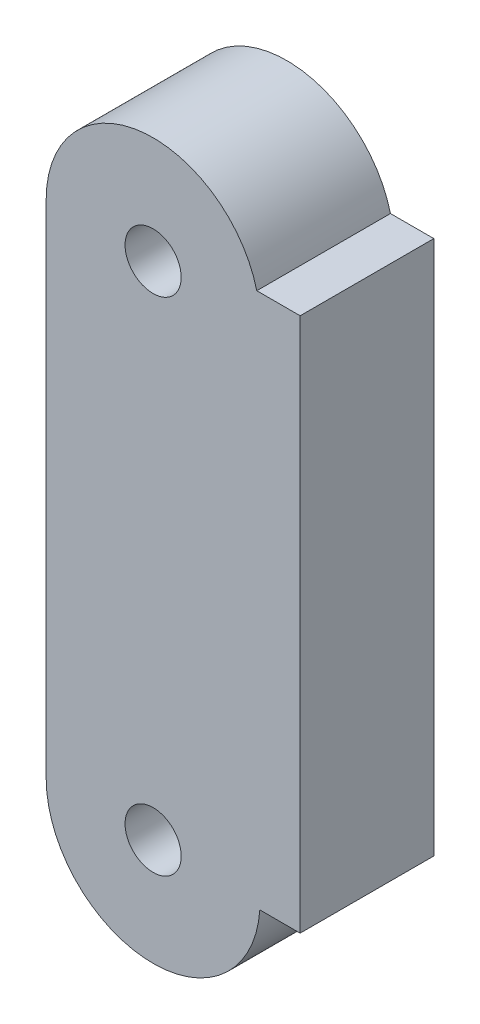
ISO-10303-21;
HEADER;
FILE_DESCRIPTION(('STEP AP214'),'2;1');
FILE_NAME('part.step','',(''),(''),'','','');
FILE_SCHEMA(('AUTOMOTIVE_DESIGN { 1 0 10303 214 1 1 1 1 }'));
ENDSEC;
DATA;
#1=APPLICATION_CONTEXT('core data for automotive mechanical design processes');
#2=APPLICATION_PROTOCOL_DEFINITION('international standard','automotive_design',2000,#1);
#3=PRODUCT_CONTEXT('',#1,'mechanical');
#4=PRODUCT('Part','Part','',(#3));
#5=PRODUCT_RELATED_PRODUCT_CATEGORY('part','',(#4));
#6=PRODUCT_DEFINITION_FORMATION('','',#4);
#7=PRODUCT_DEFINITION_CONTEXT('part definition',#1,'design');
#8=PRODUCT_DEFINITION('design','',#6,#7);
#9=PRODUCT_DEFINITION_SHAPE('','',#8);
#10=(LENGTH_UNIT() NAMED_UNIT(*) SI_UNIT(.MILLI.,.METRE.));
#11=(NAMED_UNIT(*) PLANE_ANGLE_UNIT() SI_UNIT($,.RADIAN.));
#12=(NAMED_UNIT(*) SI_UNIT($,.STERADIAN.) SOLID_ANGLE_UNIT());
#13=UNCERTAINTY_MEASURE_WITH_UNIT(LENGTH_MEASURE(1.E-05),#10,'distance_accuracy_value','');
#14=(GEOMETRIC_REPRESENTATION_CONTEXT(3) GLOBAL_UNCERTAINTY_ASSIGNED_CONTEXT((#13)) GLOBAL_UNIT_ASSIGNED_CONTEXT((#10,
#11,#12)) REPRESENTATION_CONTEXT('',''));
#15=CARTESIAN_POINT('',(0.,0.,0.));
#16=DIRECTION('',(0.,0.,1.));
#17=DIRECTION('',(1.,0.,0.));
#18=AXIS2_PLACEMENT_3D('',#15,#16,#17);
#19=CARTESIAN_POINT('',(-11.,-4.462,10.));
#20=DIRECTION('',(0.,0.,1.));
#21=DIRECTION('',(1.,0.,0.));
#22=AXIS2_PLACEMENT_3D('',#19,#20,#21);
#23=PLANE('',#22);
#24=CARTESIAN_POINT('',(-11.,-4.462,10.));
#25=DIRECTION('',(0.,0.,1.));
#26=DIRECTION('',(1.,0.,0.));
#27=AXIS2_PLACEMENT_3D('',#24,#25,#26);
#28=CIRCLE('',#27,2.1);
#29=CARTESIAN_POINT('',(-8.9,-4.462,10.));
#30=VERTEX_POINT('',#29);
#31=EDGE_CURVE('E126',#30,#30,#28,.T.);
#32=ORIENTED_EDGE('',*,*,#31,.F.);
#33=EDGE_LOOP('',(#32));
#34=FACE_BOUND('',#33,.T.);
#35=DIRECTION('',(0.,1.,0.));
#36=VECTOR('',#35,1.);
#37=CARTESIAN_POINT('',(0.,35.,10.));
#38=LINE('',#37,#36);
#39=CARTESIAN_POINT('',(0.,-5.,10.));
#40=VERTEX_POINT('',#39);
#41=CARTESIAN_POINT('',(0.,35.,10.));
#42=VERTEX_POINT('',#41);
#43=EDGE_CURVE('E133',#40,#42,#38,.T.);
#44=ORIENTED_EDGE('',*,*,#43,.T.);
#45=DIRECTION('',(-1.,0.,0.));
#46=VECTOR('',#45,1.);
#47=CARTESIAN_POINT('',(-3.24432104841878,35.,10.));
#48=LINE('',#47,#46);
#49=CARTESIAN_POINT('',(-3.24432104841878,35.,10.));
#50=VERTEX_POINT('',#49);
#51=EDGE_CURVE('E91',#42,#50,#48,.T.);
#52=ORIENTED_EDGE('',*,*,#51,.T.);
#53=CARTESIAN_POINT('',(-11.,33.038,10.));
#54=DIRECTION('',(0.,0.,1.));
#55=DIRECTION('',(1.,0.,0.));
#56=AXIS2_PLACEMENT_3D('',#53,#54,#55);
#57=CIRCLE('',#56,8.);
#58=CARTESIAN_POINT('',(-19.,33.038,10.));
#59=VERTEX_POINT('',#58);
#60=EDGE_CURVE('E104',#50,#59,#57,.T.);
#61=ORIENTED_EDGE('',*,*,#60,.T.);
#62=DIRECTION('',(0.,-1.,0.));
#63=VECTOR('',#62,1.);
#64=CARTESIAN_POINT('',(-19.,33.038,10.));
#65=LINE('',#64,#63);
#66=CARTESIAN_POINT('',(-19.,-4.462,10.));
#67=VERTEX_POINT('',#66);
#68=EDGE_CURVE('E98',#59,#67,#65,.T.);
#69=ORIENTED_EDGE('',*,*,#68,.T.);
#70=CARTESIAN_POINT('',(-11.,-4.462,10.));
#71=DIRECTION('',(0.,0.,1.));
#72=DIRECTION('',(1.,0.,0.));
#73=AXIS2_PLACEMENT_3D('',#70,#71,#72);
#74=CIRCLE('',#73,8.);
#75=CARTESIAN_POINT('',(-3.01811074995399,-5.,10.));
#76=VERTEX_POINT('',#75);
#77=EDGE_CURVE('E102',#67,#76,#74,.T.);
#78=ORIENTED_EDGE('',*,*,#77,.T.);
#79=DIRECTION('',(1.,0.,0.));
#80=VECTOR('',#79,1.);
#81=CARTESIAN_POINT('',(-3.01811074995399,-5.,10.));
#82=LINE('',#81,#80);
#83=EDGE_CURVE('E54',#76,#40,#82,.T.);
#84=ORIENTED_EDGE('',*,*,#83,.T.);
#85=EDGE_LOOP('',(#44,#52,#61,#69,#78,#84));
#86=FACE_BOUND('',#85,.T.);
#87=CARTESIAN_POINT('',(-11.,33.038,10.));
#88=DIRECTION('',(0.,0.,1.));
#89=DIRECTION('',(1.,0.,0.));
#90=AXIS2_PLACEMENT_3D('',#87,#88,#89);
#91=CIRCLE('',#90,2.1);
#92=CARTESIAN_POINT('',(-8.9,33.038,10.));
#93=VERTEX_POINT('',#92);
#94=EDGE_CURVE('E175',#93,#93,#91,.T.);
#95=ORIENTED_EDGE('',*,*,#94,.F.);
#96=EDGE_LOOP('',(#95));
#97=FACE_BOUND('',#96,.T.);
#98=ADVANCED_FACE('F37',(#34,#86,#97),#23,.T.);
#99=CARTESIAN_POINT('',(-11.,-4.462,0.));
#100=DIRECTION('',(0.,0.,1.));
#101=DIRECTION('',(1.,0.,0.));
#102=AXIS2_PLACEMENT_3D('',#99,#100,#101);
#103=PLANE('',#102);
#104=DIRECTION('',(0.,1.,0.));
#105=VECTOR('',#104,1.);
#106=CARTESIAN_POINT('',(0.,35.,0.));
#107=LINE('',#106,#105);
#108=CARTESIAN_POINT('',(0.,-5.,0.));
#109=VERTEX_POINT('',#108);
#110=CARTESIAN_POINT('',(0.,35.,0.));
#111=VERTEX_POINT('',#110);
#112=EDGE_CURVE('E122',#109,#111,#107,.T.);
#113=ORIENTED_EDGE('',*,*,#112,.F.);
#114=DIRECTION('',(1.,0.,0.));
#115=VECTOR('',#114,1.);
#116=CARTESIAN_POINT('',(-3.01811074995399,-5.,0.));
#117=LINE('',#116,#115);
#118=CARTESIAN_POINT('',(-3.01811074995399,-5.,0.));
#119=VERTEX_POINT('',#118);
#120=EDGE_CURVE('E83',#119,#109,#117,.T.);
#121=ORIENTED_EDGE('',*,*,#120,.F.);
#122=CARTESIAN_POINT('',(-11.,-4.462,0.));
#123=DIRECTION('',(0.,0.,1.));
#124=DIRECTION('',(1.,0.,0.));
#125=AXIS2_PLACEMENT_3D('',#122,#123,#124);
#126=CIRCLE('',#125,8.);
#127=CARTESIAN_POINT('',(-19.,-4.462,0.));
#128=VERTEX_POINT('',#127);
#129=EDGE_CURVE('E77',#128,#119,#126,.T.);
#130=ORIENTED_EDGE('',*,*,#129,.F.);
#131=DIRECTION('',(0.,-1.,0.));
#132=VECTOR('',#131,1.);
#133=CARTESIAN_POINT('',(-19.,33.038,0.));
#134=LINE('',#133,#132);
#135=CARTESIAN_POINT('',(-19.,33.038,0.));
#136=VERTEX_POINT('',#135);
#137=EDGE_CURVE('E112',#136,#128,#134,.T.);
#138=ORIENTED_EDGE('',*,*,#137,.F.);
#139=CARTESIAN_POINT('',(-11.,33.038,0.));
#140=DIRECTION('',(0.,0.,1.));
#141=DIRECTION('',(1.,0.,0.));
#142=AXIS2_PLACEMENT_3D('',#139,#140,#141);
#143=CIRCLE('',#142,8.);
#144=CARTESIAN_POINT('',(-3.24432104841878,35.,0.));
#145=VERTEX_POINT('',#144);
#146=EDGE_CURVE('E128',#145,#136,#143,.T.);
#147=ORIENTED_EDGE('',*,*,#146,.F.);
#148=DIRECTION('',(-1.,0.,0.));
#149=VECTOR('',#148,1.);
#150=CARTESIAN_POINT('',(-3.24432104841878,35.,0.));
#151=LINE('',#150,#149);
#152=EDGE_CURVE('E125',#111,#145,#151,.T.);
#153=ORIENTED_EDGE('',*,*,#152,.F.);
#154=EDGE_LOOP('',(#113,#121,#130,#138,#147,#153));
#155=FACE_BOUND('',#154,.T.);
#156=CARTESIAN_POINT('',(-11.,-4.462,0.));
#157=DIRECTION('',(0.,0.,1.));
#158=DIRECTION('',(1.,0.,0.));
#159=AXIS2_PLACEMENT_3D('',#156,#157,#158);
#160=CIRCLE('',#159,2.1);
#161=CARTESIAN_POINT('',(-8.9,-4.462,0.));
#162=VERTEX_POINT('',#161);
#163=EDGE_CURVE('E181',#162,#162,#160,.T.);
#164=ORIENTED_EDGE('',*,*,#163,.T.);
#165=EDGE_LOOP('',(#164));
#166=FACE_BOUND('',#165,.T.);
#167=CARTESIAN_POINT('',(-11.,33.038,0.));
#168=DIRECTION('',(0.,0.,1.));
#169=DIRECTION('',(1.,0.,0.));
#170=AXIS2_PLACEMENT_3D('',#167,#168,#169);
#171=CIRCLE('',#170,2.1);
#172=CARTESIAN_POINT('',(-8.9,33.038,0.));
#173=VERTEX_POINT('',#172);
#174=EDGE_CURVE('E178',#173,#173,#171,.T.);
#175=ORIENTED_EDGE('',*,*,#174,.T.);
#176=EDGE_LOOP('',(#175));
#177=FACE_BOUND('',#176,.T.);
#178=ADVANCED_FACE('F142',(#155,#166,#177),#103,.F.);
#179=CARTESIAN_POINT('',(0.,35.,10.));
#180=DIRECTION('',(-1.,0.,0.));
#181=DIRECTION('',(0.,0.,1.));
#182=AXIS2_PLACEMENT_3D('',#179,#180,#181);
#183=PLANE('',#182);
#184=ORIENTED_EDGE('',*,*,#112,.T.);
#185=DIRECTION('',(0.,0.,-1.));
#186=VECTOR('',#185,1.);
#187=CARTESIAN_POINT('',(0.,35.,10.));
#188=LINE('',#187,#186);
#189=EDGE_CURVE('E11',#42,#111,#188,.T.);
#190=ORIENTED_EDGE('',*,*,#189,.F.);
#191=ORIENTED_EDGE('',*,*,#43,.F.);
#192=DIRECTION('',(0.,0.,-1.));
#193=VECTOR('',#192,1.);
#194=CARTESIAN_POINT('',(0.,-5.,10.));
#195=LINE('',#194,#193);
#196=EDGE_CURVE('E118',#40,#109,#195,.T.);
#197=ORIENTED_EDGE('',*,*,#196,.T.);
#198=EDGE_LOOP('',(#184,#190,#191,#197));
#199=FACE_BOUND('',#198,.T.);
#200=ADVANCED_FACE('F39',(#199),#183,.F.);
#201=CARTESIAN_POINT('',(-3.24432104841878,35.,10.));
#202=DIRECTION('',(0.,-1.,0.));
#203=DIRECTION('',(0.,0.,-1.));
#204=AXIS2_PLACEMENT_3D('',#201,#202,#203);
#205=PLANE('',#204);
#206=ORIENTED_EDGE('',*,*,#152,.T.);
#207=DIRECTION('',(0.,0.,-1.));
#208=VECTOR('',#207,1.);
#209=CARTESIAN_POINT('',(-3.24432104841878,35.,10.));
#210=LINE('',#209,#208);
#211=EDGE_CURVE('E46',#50,#145,#210,.T.);
#212=ORIENTED_EDGE('',*,*,#211,.F.);
#213=ORIENTED_EDGE('',*,*,#51,.F.);
#214=ORIENTED_EDGE('',*,*,#189,.T.);
#215=EDGE_LOOP('',(#206,#212,#213,#214));
#216=FACE_BOUND('',#215,.T.);
#217=ADVANCED_FACE('F226',(#216),#205,.F.);
#218=CARTESIAN_POINT('',(-11.,33.038,10.));
#219=DIRECTION('',(0.,0.,-1.));
#220=DIRECTION('',(-1.,0.,0.));
#221=AXIS2_PLACEMENT_3D('',#218,#219,#220);
#222=CYLINDRICAL_SURFACE('',#221,8.);
#223=ORIENTED_EDGE('',*,*,#146,.T.);
#224=DIRECTION('',(0.,0.,-1.));
#225=VECTOR('',#224,1.);
#226=CARTESIAN_POINT('',(-19.,33.038,10.));
#227=LINE('',#226,#225);
#228=EDGE_CURVE('E113',#59,#136,#227,.T.);
#229=ORIENTED_EDGE('',*,*,#228,.F.);
#230=ORIENTED_EDGE('',*,*,#60,.F.);
#231=ORIENTED_EDGE('',*,*,#211,.T.);
#232=EDGE_LOOP('',(#223,#229,#230,#231));
#233=FACE_BOUND('',#232,.T.);
#234=ADVANCED_FACE('F139',(#233),#222,.T.);
#235=CARTESIAN_POINT('',(-19.,33.038,10.));
#236=DIRECTION('',(1.,0.,0.));
#237=DIRECTION('',(0.,0.,-1.));
#238=AXIS2_PLACEMENT_3D('',#235,#236,#237);
#239=PLANE('',#238);
#240=ORIENTED_EDGE('',*,*,#137,.T.);
#241=DIRECTION('',(0.,0.,-1.));
#242=VECTOR('',#241,1.);
#243=CARTESIAN_POINT('',(-19.,-4.462,10.));
#244=LINE('',#243,#242);
#245=EDGE_CURVE('E109',#67,#128,#244,.T.);
#246=ORIENTED_EDGE('',*,*,#245,.F.);
#247=ORIENTED_EDGE('',*,*,#68,.F.);
#248=ORIENTED_EDGE('',*,*,#228,.T.);
#249=EDGE_LOOP('',(#240,#246,#247,#248));
#250=FACE_BOUND('',#249,.T.);
#251=ADVANCED_FACE('F110',(#250),#239,.F.);
#252=CARTESIAN_POINT('',(-11.,-4.462,10.));
#253=DIRECTION('',(0.,0.,-1.));
#254=DIRECTION('',(-1.,0.,0.));
#255=AXIS2_PLACEMENT_3D('',#252,#253,#254);
#256=CYLINDRICAL_SURFACE('',#255,8.);
#257=ORIENTED_EDGE('',*,*,#129,.T.);
#258=DIRECTION('',(0.,0.,-1.));
#259=VECTOR('',#258,1.);
#260=CARTESIAN_POINT('',(-3.01811074995399,-5.,10.));
#261=LINE('',#260,#259);
#262=EDGE_CURVE('E114',#76,#119,#261,.T.);
#263=ORIENTED_EDGE('',*,*,#262,.F.);
#264=ORIENTED_EDGE('',*,*,#77,.F.);
#265=ORIENTED_EDGE('',*,*,#245,.T.);
#266=EDGE_LOOP('',(#257,#263,#264,#265));
#267=FACE_BOUND('',#266,.T.);
#268=ADVANCED_FACE('F116',(#267),#256,.T.);
#269=CARTESIAN_POINT('',(-3.01811074995399,-5.,10.));
#270=DIRECTION('',(0.,1.,0.));
#271=DIRECTION('',(0.,0.,1.));
#272=AXIS2_PLACEMENT_3D('',#269,#270,#271);
#273=PLANE('',#272);
#274=ORIENTED_EDGE('',*,*,#120,.T.);
#275=ORIENTED_EDGE('',*,*,#196,.F.);
#276=ORIENTED_EDGE('',*,*,#83,.F.);
#277=ORIENTED_EDGE('',*,*,#262,.T.);
#278=EDGE_LOOP('',(#274,#275,#276,#277));
#279=FACE_BOUND('',#278,.T.);
#280=ADVANCED_FACE('F147',(#279),#273,.F.);
#281=CARTESIAN_POINT('',(-11.,-4.462,10.));
#282=DIRECTION('',(0.,0.,-1.));
#283=DIRECTION('',(-1.,0.,0.));
#284=AXIS2_PLACEMENT_3D('',#281,#282,#283);
#285=CYLINDRICAL_SURFACE('',#284,2.1);
#286=ORIENTED_EDGE('',*,*,#31,.T.);
#287=EDGE_LOOP('',(#286));
#288=FACE_BOUND('',#287,.T.);
#289=ORIENTED_EDGE('',*,*,#163,.F.);
#290=EDGE_LOOP('',(#289));
#291=FACE_BOUND('',#290,.T.);
#292=ADVANCED_FACE('F149',(#288,#291),#285,.F.);
#293=CARTESIAN_POINT('',(-11.,33.038,10.));
#294=DIRECTION('',(0.,0.,-1.));
#295=DIRECTION('',(-1.,0.,0.));
#296=AXIS2_PLACEMENT_3D('',#293,#294,#295);
#297=CYLINDRICAL_SURFACE('',#296,2.1);
#298=ORIENTED_EDGE('',*,*,#94,.T.);
#299=EDGE_LOOP('',(#298));
#300=FACE_BOUND('',#299,.T.);
#301=ORIENTED_EDGE('',*,*,#174,.F.);
#302=EDGE_LOOP('',(#301));
#303=FACE_BOUND('',#302,.T.);
#304=ADVANCED_FACE('F155',(#300,#303),#297,.F.);
#305=CLOSED_SHELL('',(#98,#178,#200,#217,#234,#251,#268,#280,#292,#304));
#306=MANIFOLD_SOLID_BREP('B2',#305);
#307=ADVANCED_BREP_SHAPE_REPRESENTATION('',(#18,#306),#14);
#308=SHAPE_DEFINITION_REPRESENTATION(#9,#307);
ENDSEC;
END-ISO-10303-21;
